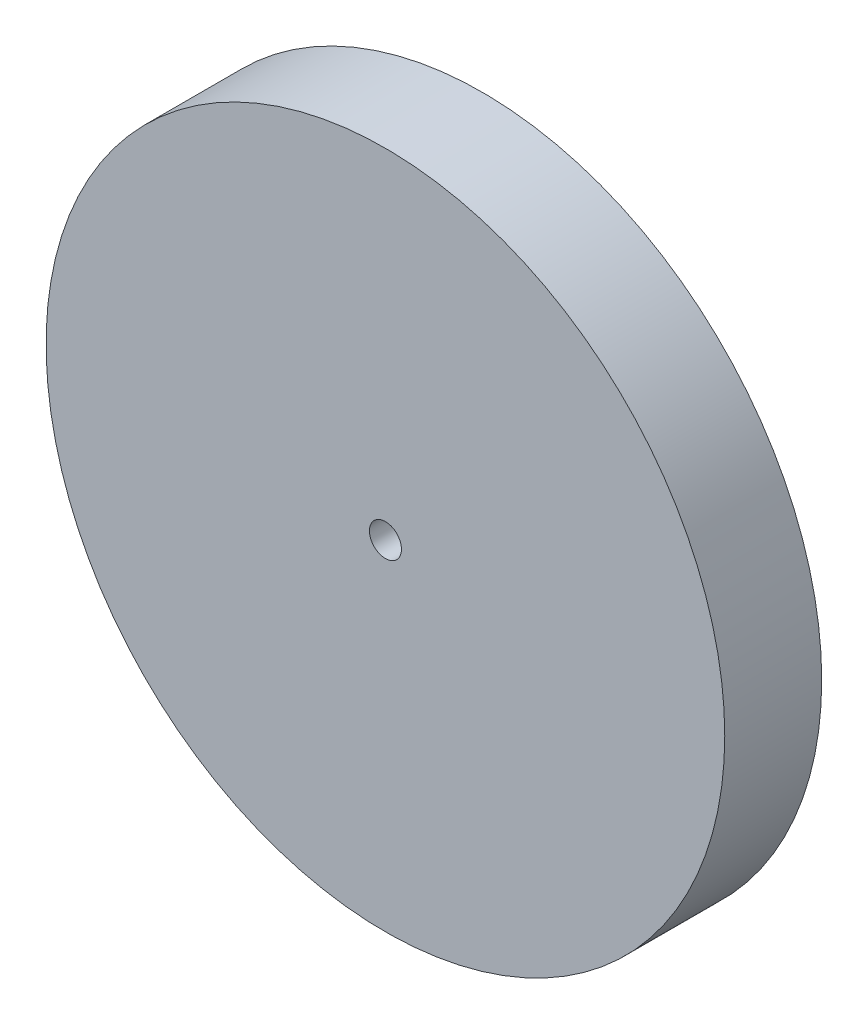
ISO-10303-21;
HEADER;
FILE_DESCRIPTION(('STEP AP214'),'2;1');
FILE_NAME('part.step','',(''),(''),'','','');
FILE_SCHEMA(('AUTOMOTIVE_DESIGN { 1 0 10303 214 1 1 1 1 }'));
ENDSEC;
DATA;
#1=APPLICATION_CONTEXT('core data for automotive mechanical design processes');
#2=APPLICATION_PROTOCOL_DEFINITION('international standard','automotive_design',2000,#1);
#3=PRODUCT_CONTEXT('',#1,'mechanical');
#4=PRODUCT('Part','Part','',(#3));
#5=PRODUCT_RELATED_PRODUCT_CATEGORY('part','',(#4));
#6=PRODUCT_DEFINITION_FORMATION('','',#4);
#7=PRODUCT_DEFINITION_CONTEXT('part definition',#1,'design');
#8=PRODUCT_DEFINITION('design','',#6,#7);
#9=PRODUCT_DEFINITION_SHAPE('','',#8);
#10=(LENGTH_UNIT() NAMED_UNIT(*) SI_UNIT(.MILLI.,.METRE.));
#11=(NAMED_UNIT(*) PLANE_ANGLE_UNIT() SI_UNIT($,.RADIAN.));
#12=(NAMED_UNIT(*) SI_UNIT($,.STERADIAN.) SOLID_ANGLE_UNIT());
#13=UNCERTAINTY_MEASURE_WITH_UNIT(LENGTH_MEASURE(1.E-05),#10,'distance_accuracy_value','');
#14=(GEOMETRIC_REPRESENTATION_CONTEXT(3) GLOBAL_UNCERTAINTY_ASSIGNED_CONTEXT((#13)) GLOBAL_UNIT_ASSIGNED_CONTEXT((#10,
#11,#12)) REPRESENTATION_CONTEXT('',''));
#15=CARTESIAN_POINT('',(0.,0.,0.));
#16=DIRECTION('',(0.,0.,1.));
#17=DIRECTION('',(1.,0.,0.));
#18=AXIS2_PLACEMENT_3D('',#15,#16,#17);
#19=CARTESIAN_POINT('',(0.,0.,10.));
#20=DIRECTION('',(0.,0.,-1.));
#21=DIRECTION('',(-1.,0.,0.));
#22=AXIS2_PLACEMENT_3D('',#19,#20,#21);
#23=CYLINDRICAL_SURFACE('',#22,35.);
#24=CARTESIAN_POINT('',(0.,0.,10.));
#25=DIRECTION('',(0.,0.,1.));
#26=DIRECTION('',(1.,0.,0.));
#27=AXIS2_PLACEMENT_3D('',#24,#25,#26);
#28=CIRCLE('',#27,35.);
#29=CARTESIAN_POINT('',(35.,0.,10.));
#30=VERTEX_POINT('',#29);
#31=EDGE_CURVE('E37',#30,#30,#28,.T.);
#32=ORIENTED_EDGE('',*,*,#31,.F.);
#33=EDGE_LOOP('',(#32));
#34=FACE_BOUND('',#33,.T.);
#35=CARTESIAN_POINT('',(0.,0.,0.));
#36=DIRECTION('',(0.,0.,1.));
#37=DIRECTION('',(1.,0.,0.));
#38=AXIS2_PLACEMENT_3D('',#35,#36,#37);
#39=CIRCLE('',#38,35.);
#40=CARTESIAN_POINT('',(35.,0.,0.));
#41=VERTEX_POINT('',#40);
#42=EDGE_CURVE('E41',#41,#41,#39,.T.);
#43=ORIENTED_EDGE('',*,*,#42,.T.);
#44=EDGE_LOOP('',(#43));
#45=FACE_BOUND('',#44,.T.);
#46=ADVANCED_FACE('F31',(#34,#45),#23,.T.);
#47=CARTESIAN_POINT('',(0.,0.,10.));
#48=DIRECTION('',(0.,0.,1.));
#49=DIRECTION('',(1.,0.,0.));
#50=AXIS2_PLACEMENT_3D('',#47,#48,#49);
#51=PLANE('',#50);
#52=CARTESIAN_POINT('',(0.,0.,10.));
#53=DIRECTION('',(0.,0.,1.));
#54=DIRECTION('',(1.,0.,0.));
#55=AXIS2_PLACEMENT_3D('',#52,#53,#54);
#56=CIRCLE('',#55,1.65);
#57=CARTESIAN_POINT('',(1.65,0.,10.));
#58=VERTEX_POINT('',#57);
#59=EDGE_CURVE('E51',#58,#58,#56,.T.);
#60=ORIENTED_EDGE('',*,*,#59,.F.);
#61=EDGE_LOOP('',(#60));
#62=FACE_BOUND('',#61,.T.);
#63=ORIENTED_EDGE('',*,*,#31,.T.);
#64=EDGE_LOOP('',(#63));
#65=FACE_BOUND('',#64,.T.);
#66=ADVANCED_FACE('F66',(#62,#65),#51,.T.);
#67=CARTESIAN_POINT('',(0.,0.,0.));
#68=DIRECTION('',(0.,0.,1.));
#69=DIRECTION('',(1.,0.,0.));
#70=AXIS2_PLACEMENT_3D('',#67,#68,#69);
#71=PLANE('',#70);
#72=CARTESIAN_POINT('',(0.,0.,0.));
#73=DIRECTION('',(0.,0.,1.));
#74=DIRECTION('',(1.,0.,0.));
#75=AXIS2_PLACEMENT_3D('',#72,#73,#74);
#76=CIRCLE('',#75,1.5);
#77=CARTESIAN_POINT('',(1.5,0.,0.));
#78=VERTEX_POINT('',#77);
#79=EDGE_CURVE('E10',#78,#78,#76,.F.);
#80=ORIENTED_EDGE('',*,*,#79,.F.);
#81=EDGE_LOOP('',(#80));
#82=FACE_BOUND('',#81,.T.);
#83=ORIENTED_EDGE('',*,*,#42,.F.);
#84=EDGE_LOOP('',(#83));
#85=FACE_BOUND('',#84,.T.);
#86=ADVANCED_FACE('F68',(#82,#85),#71,.F.);
#87=CARTESIAN_POINT('',(0.,0.,-5.));
#88=DIRECTION('',(0.,0.,1.));
#89=DIRECTION('',(1.,0.,0.));
#90=AXIS2_PLACEMENT_3D('',#87,#88,#89);
#91=CYLINDRICAL_SURFACE('',#90,1.5);
#92=CARTESIAN_POINT('',(0.,0.,-5.));
#93=DIRECTION('',(0.,0.,-1.));
#94=DIRECTION('',(-1.,0.,0.));
#95=AXIS2_PLACEMENT_3D('',#92,#93,#94);
#96=CIRCLE('',#95,1.5);
#97=CARTESIAN_POINT('',(-1.5,0.,-5.));
#98=VERTEX_POINT('',#97);
#99=EDGE_CURVE('E46',#98,#98,#96,.T.);
#100=ORIENTED_EDGE('',*,*,#99,.F.);
#101=EDGE_LOOP('',(#100));
#102=FACE_BOUND('',#101,.T.);
#103=ORIENTED_EDGE('',*,*,#79,.T.);
#104=EDGE_LOOP('',(#103));
#105=FACE_BOUND('',#104,.T.);
#106=ADVANCED_FACE('F74',(#102,#105),#91,.T.);
#107=CARTESIAN_POINT('',(0.,0.,-5.));
#108=DIRECTION('',(0.,0.,-1.));
#109=DIRECTION('',(-1.,0.,0.));
#110=AXIS2_PLACEMENT_3D('',#107,#108,#109);
#111=PLANE('',#110);
#112=ORIENTED_EDGE('',*,*,#99,.T.);
#113=EDGE_LOOP('',(#112));
#114=FACE_BOUND('',#113,.T.);
#115=ADVANCED_FACE('F62',(#114),#111,.T.);
#116=CARTESIAN_POINT('',(0.,0.,5.));
#117=DIRECTION('',(0.,0.,1.));
#118=DIRECTION('',(1.,0.,0.));
#119=AXIS2_PLACEMENT_3D('',#116,#117,#118);
#120=CYLINDRICAL_SURFACE('',#119,1.65);
#121=CARTESIAN_POINT('',(0.,0.,5.));
#122=DIRECTION('',(0.,0.,1.));
#123=DIRECTION('',(1.,0.,0.));
#124=AXIS2_PLACEMENT_3D('',#121,#122,#123);
#125=CIRCLE('',#124,1.65);
#126=CARTESIAN_POINT('',(1.65,0.,5.));
#127=VERTEX_POINT('',#126);
#128=EDGE_CURVE('E50',#127,#127,#125,.T.);
#129=ORIENTED_EDGE('',*,*,#128,.F.);
#130=EDGE_LOOP('',(#129));
#131=FACE_BOUND('',#130,.T.);
#132=ORIENTED_EDGE('',*,*,#59,.T.);
#133=EDGE_LOOP('',(#132));
#134=FACE_BOUND('',#133,.T.);
#135=ADVANCED_FACE('F59',(#131,#134),#120,.F.);
#136=CARTESIAN_POINT('',(0.,0.,5.));
#137=DIRECTION('',(0.,0.,1.));
#138=DIRECTION('',(1.,0.,0.));
#139=AXIS2_PLACEMENT_3D('',#136,#137,#138);
#140=PLANE('',#139);
#141=ORIENTED_EDGE('',*,*,#128,.T.);
#142=EDGE_LOOP('',(#141));
#143=FACE_BOUND('',#142,.T.);
#144=ADVANCED_FACE('F57',(#143),#140,.T.);
#145=CLOSED_SHELL('',(#46,#66,#86,#106,#115,#135,#144));
#146=MANIFOLD_SOLID_BREP('B2',#145);
#147=ADVANCED_BREP_SHAPE_REPRESENTATION('',(#18,#146),#14);
#148=SHAPE_DEFINITION_REPRESENTATION(#9,#147);
ENDSEC;
END-ISO-10303-21;
